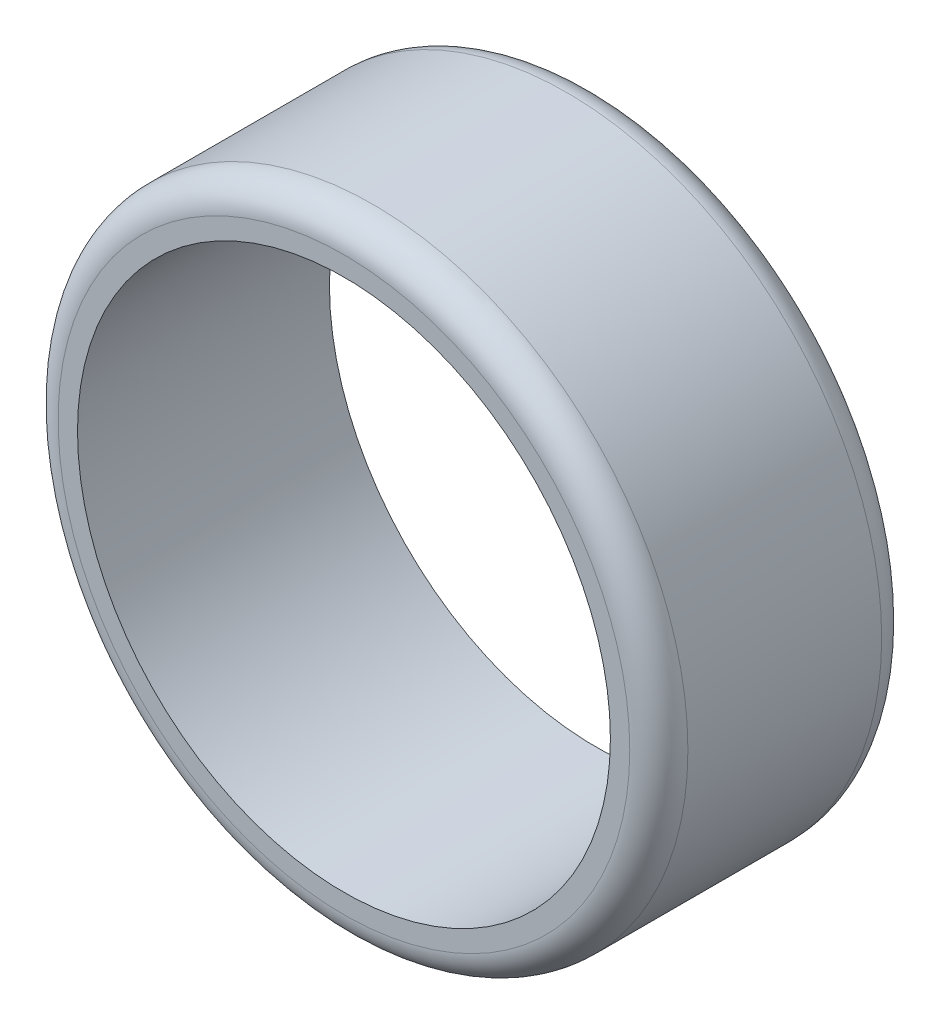
ISO-10303-21;
HEADER;
FILE_DESCRIPTION(('STEP AP214'),'2;1');
FILE_NAME('part.step','',(''),(''),'','','');
FILE_SCHEMA(('AUTOMOTIVE_DESIGN { 1 0 10303 214 1 1 1 1 }'));
ENDSEC;
DATA;
#1=APPLICATION_CONTEXT('core data for automotive mechanical design processes');
#2=APPLICATION_PROTOCOL_DEFINITION('international standard','automotive_design',2000,#1);
#3=PRODUCT_CONTEXT('',#1,'mechanical');
#4=PRODUCT('Part','Part','',(#3));
#5=PRODUCT_RELATED_PRODUCT_CATEGORY('part','',(#4));
#6=PRODUCT_DEFINITION_FORMATION('','',#4);
#7=PRODUCT_DEFINITION_CONTEXT('part definition',#1,'design');
#8=PRODUCT_DEFINITION('design','',#6,#7);
#9=PRODUCT_DEFINITION_SHAPE('','',#8);
#10=(LENGTH_UNIT() NAMED_UNIT(*) SI_UNIT(.MILLI.,.METRE.));
#11=(NAMED_UNIT(*) PLANE_ANGLE_UNIT() SI_UNIT($,.RADIAN.));
#12=(NAMED_UNIT(*) SI_UNIT($,.STERADIAN.) SOLID_ANGLE_UNIT());
#13=UNCERTAINTY_MEASURE_WITH_UNIT(LENGTH_MEASURE(1.E-05),#10,'distance_accuracy_value','');
#14=(GEOMETRIC_REPRESENTATION_CONTEXT(3) GLOBAL_UNCERTAINTY_ASSIGNED_CONTEXT((#13)) GLOBAL_UNIT_ASSIGNED_CONTEXT((#10,
#11,#12)) REPRESENTATION_CONTEXT('',''));
#15=CARTESIAN_POINT('',(0.,0.,0.));
#16=DIRECTION('',(0.,0.,1.));
#17=DIRECTION('',(1.,0.,0.));
#18=AXIS2_PLACEMENT_3D('',#15,#16,#17);
#19=CARTESIAN_POINT('',(0.,0.,26.));
#20=DIRECTION('',(0.,0.,1.));
#21=DIRECTION('',(1.,0.,0.));
#22=AXIS2_PLACEMENT_3D('',#19,#20,#21);
#23=PLANE('',#22);
#24=CARTESIAN_POINT('',(0.,0.,26.));
#25=DIRECTION('',(0.,0.,1.));
#26=DIRECTION('',(1.,0.,0.));
#27=AXIS2_PLACEMENT_3D('',#24,#25,#26);
#28=CIRCLE('',#27,29.5);
#29=CARTESIAN_POINT('',(29.5,0.,26.));
#30=VERTEX_POINT('',#29);
#31=EDGE_CURVE('E48',#30,#30,#28,.T.);
#32=ORIENTED_EDGE('',*,*,#31,.T.);
#33=EDGE_LOOP('',(#32));
#34=FACE_BOUND('',#33,.T.);
#35=CARTESIAN_POINT('',(0.,0.,26.));
#36=DIRECTION('',(0.,0.,1.));
#37=DIRECTION('',(1.,0.,0.));
#38=AXIS2_PLACEMENT_3D('',#35,#36,#37);
#39=CIRCLE('',#38,27.5);
#40=CARTESIAN_POINT('',(27.5,0.,26.));
#41=VERTEX_POINT('',#40);
#42=EDGE_CURVE('E53',#41,#41,#39,.T.);
#43=ORIENTED_EDGE('',*,*,#42,.F.);
#44=EDGE_LOOP('',(#43));
#45=FACE_BOUND('',#44,.T.);
#46=ADVANCED_FACE('F33',(#34,#45),#23,.T.);
#47=CARTESIAN_POINT('',(0.,0.,0.));
#48=DIRECTION('',(0.,0.,1.));
#49=DIRECTION('',(1.,0.,0.));
#50=AXIS2_PLACEMENT_3D('',#47,#48,#49);
#51=PLANE('',#50);
#52=CARTESIAN_POINT('',(0.,0.,0.));
#53=DIRECTION('',(0.,0.,1.));
#54=DIRECTION('',(1.,0.,0.));
#55=AXIS2_PLACEMENT_3D('',#52,#53,#54);
#56=CIRCLE('',#55,29.5);
#57=CARTESIAN_POINT('',(29.5,0.,0.));
#58=VERTEX_POINT('',#57);
#59=EDGE_CURVE('E10',#58,#58,#56,.F.);
#60=ORIENTED_EDGE('',*,*,#59,.T.);
#61=EDGE_LOOP('',(#60));
#62=FACE_BOUND('',#61,.T.);
#63=CARTESIAN_POINT('',(0.,0.,0.));
#64=DIRECTION('',(0.,0.,1.));
#65=DIRECTION('',(1.,0.,0.));
#66=AXIS2_PLACEMENT_3D('',#63,#64,#65);
#67=CIRCLE('',#66,27.5);
#68=CARTESIAN_POINT('',(27.5,0.,0.));
#69=VERTEX_POINT('',#68);
#70=EDGE_CURVE('E54',#69,#69,#67,.T.);
#71=ORIENTED_EDGE('',*,*,#70,.T.);
#72=EDGE_LOOP('',(#71));
#73=FACE_BOUND('',#72,.T.);
#74=ADVANCED_FACE('F64',(#62,#73),#51,.F.);
#75=CARTESIAN_POINT('',(0.,0.,26.));
#76=DIRECTION('',(0.,0.,-1.));
#77=DIRECTION('',(-1.,0.,0.));
#78=AXIS2_PLACEMENT_3D('',#75,#76,#77);
#79=CYLINDRICAL_SURFACE('',#78,32.5);
#80=CARTESIAN_POINT('',(0.,0.,23.));
#81=DIRECTION('',(0.,0.,1.));
#82=DIRECTION('',(1.,0.,0.));
#83=AXIS2_PLACEMENT_3D('',#80,#81,#82);
#84=CIRCLE('',#83,32.5);
#85=CARTESIAN_POINT('',(32.5,0.,23.));
#86=VERTEX_POINT('',#85);
#87=EDGE_CURVE('E40',#86,#86,#84,.F.);
#88=ORIENTED_EDGE('',*,*,#87,.T.);
#89=EDGE_LOOP('',(#88));
#90=FACE_BOUND('',#89,.T.);
#91=CARTESIAN_POINT('',(0.,0.,3.));
#92=DIRECTION('',(0.,0.,1.));
#93=DIRECTION('',(1.,0.,0.));
#94=AXIS2_PLACEMENT_3D('',#91,#92,#93);
#95=CIRCLE('',#94,32.5);
#96=CARTESIAN_POINT('',(32.5,0.,3.));
#97=VERTEX_POINT('',#96);
#98=EDGE_CURVE('E44',#97,#97,#95,.T.);
#99=ORIENTED_EDGE('',*,*,#98,.T.);
#100=EDGE_LOOP('',(#99));
#101=FACE_BOUND('',#100,.T.);
#102=ADVANCED_FACE('F70',(#90,#101),#79,.T.);
#103=CARTESIAN_POINT('',(0.,0.,26.));
#104=DIRECTION('',(0.,0.,-1.));
#105=DIRECTION('',(-1.,0.,0.));
#106=AXIS2_PLACEMENT_3D('',#103,#104,#105);
#107=CYLINDRICAL_SURFACE('',#106,27.5);
#108=ORIENTED_EDGE('',*,*,#42,.T.);
#109=EDGE_LOOP('',(#108));
#110=FACE_BOUND('',#109,.T.);
#111=ORIENTED_EDGE('',*,*,#70,.F.);
#112=EDGE_LOOP('',(#111));
#113=FACE_BOUND('',#112,.T.);
#114=ADVANCED_FACE('F60',(#110,#113),#107,.F.);
#115=CARTESIAN_POINT('',(0.,0.,23.));
#116=DIRECTION('',(0.,0.,1.));
#117=DIRECTION('',(1.,0.,0.));
#118=AXIS2_PLACEMENT_3D('',#115,#116,#117);
#119=TOROIDAL_SURFACE('',#118,29.5,3.);
#120=ORIENTED_EDGE('',*,*,#87,.F.);
#121=EDGE_LOOP('',(#120));
#122=FACE_BOUND('',#121,.T.);
#123=ORIENTED_EDGE('',*,*,#31,.F.);
#124=EDGE_LOOP('',(#123));
#125=FACE_BOUND('',#124,.T.);
#126=ADVANCED_FACE('F75',(#122,#125),#119,.T.);
#127=CARTESIAN_POINT('',(0.,0.,3.));
#128=DIRECTION('',(0.,0.,1.));
#129=DIRECTION('',(1.,0.,0.));
#130=AXIS2_PLACEMENT_3D('',#127,#128,#129);
#131=TOROIDAL_SURFACE('',#130,29.5,3.);
#132=ORIENTED_EDGE('',*,*,#59,.F.);
#133=EDGE_LOOP('',(#132));
#134=FACE_BOUND('',#133,.T.);
#135=ORIENTED_EDGE('',*,*,#98,.F.);
#136=EDGE_LOOP('',(#135));
#137=FACE_BOUND('',#136,.T.);
#138=ADVANCED_FACE('F35',(#134,#137),#131,.T.);
#139=CLOSED_SHELL('',(#46,#74,#102,#114,#126,#138));
#140=MANIFOLD_SOLID_BREP('B2',#139);
#141=ADVANCED_BREP_SHAPE_REPRESENTATION('',(#18,#140),#14);
#142=SHAPE_DEFINITION_REPRESENTATION(#9,#141);
ENDSEC;
END-ISO-10303-21;
